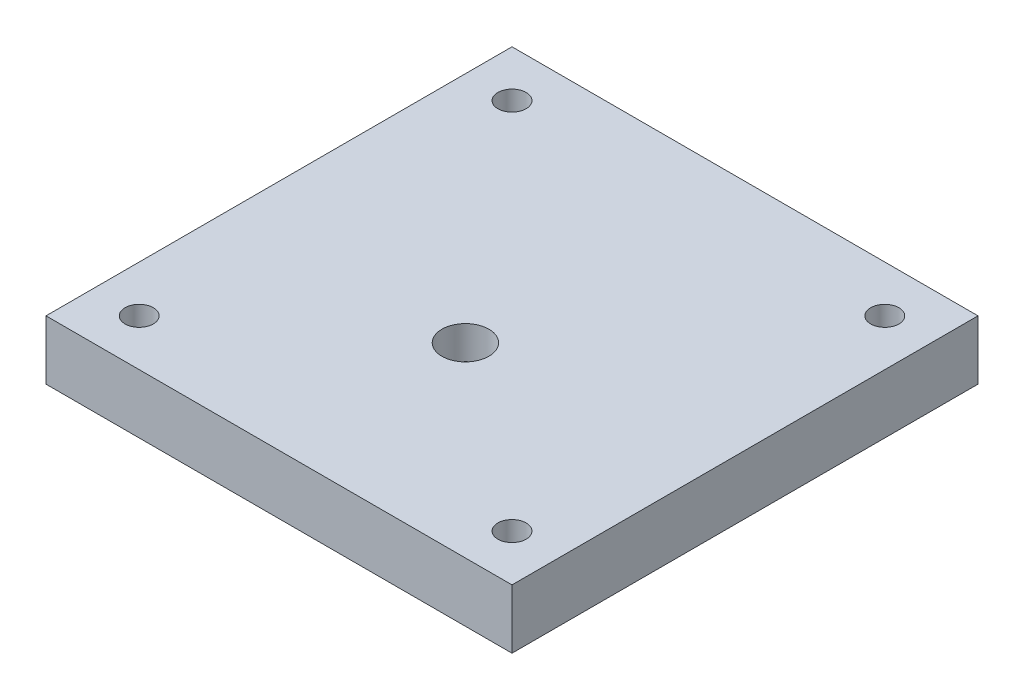
ISO-10303-21;
HEADER;
FILE_DESCRIPTION(('STEP AP214'),'2;1');
FILE_NAME('part.step','',(''),(''),'','','');
FILE_SCHEMA(('AUTOMOTIVE_DESIGN { 1 0 10303 214 1 1 1 1 }'));
ENDSEC;
DATA;
#1=APPLICATION_CONTEXT('core data for automotive mechanical design processes');
#2=APPLICATION_PROTOCOL_DEFINITION('international standard','automotive_design',2000,#1);
#3=PRODUCT_CONTEXT('',#1,'mechanical');
#4=PRODUCT('Part','Part','',(#3));
#5=PRODUCT_RELATED_PRODUCT_CATEGORY('part','',(#4));
#6=PRODUCT_DEFINITION_FORMATION('','',#4);
#7=PRODUCT_DEFINITION_CONTEXT('part definition',#1,'design');
#8=PRODUCT_DEFINITION('design','',#6,#7);
#9=PRODUCT_DEFINITION_SHAPE('','',#8);
#10=(LENGTH_UNIT() NAMED_UNIT(*) SI_UNIT(.MILLI.,.METRE.));
#11=(NAMED_UNIT(*) PLANE_ANGLE_UNIT() SI_UNIT($,.RADIAN.));
#12=(NAMED_UNIT(*) SI_UNIT($,.STERADIAN.) SOLID_ANGLE_UNIT());
#13=UNCERTAINTY_MEASURE_WITH_UNIT(LENGTH_MEASURE(1.E-05),#10,'distance_accuracy_value','');
#14=(GEOMETRIC_REPRESENTATION_CONTEXT(3) GLOBAL_UNCERTAINTY_ASSIGNED_CONTEXT((#13)) GLOBAL_UNIT_ASSIGNED_CONTEXT((#10,
#11,#12)) REPRESENTATION_CONTEXT('',''));
#15=CARTESIAN_POINT('',(0.,0.,0.));
#16=DIRECTION('',(0.,0.,1.));
#17=DIRECTION('',(1.,0.,0.));
#18=AXIS2_PLACEMENT_3D('',#15,#16,#17);
#19=CARTESIAN_POINT('',(-50.,12.7,-60.));
#20=DIRECTION('',(0.,0.,-1.));
#21=DIRECTION('',(-1.,0.,0.));
#22=AXIS2_PLACEMENT_3D('',#19,#20,#21);
#23=PLANE('',#22);
#24=DIRECTION('',(1.,0.,0.));
#25=VECTOR('',#24,1.);
#26=CARTESIAN_POINT('',(-50.,0.,-60.));
#27=LINE('',#26,#25);
#28=CARTESIAN_POINT('',(-50.,0.,-60.));
#29=VERTEX_POINT('',#28);
#30=CARTESIAN_POINT('',(50.,0.,-60.));
#31=VERTEX_POINT('',#30);
#32=EDGE_CURVE('E98',#29,#31,#27,.T.);
#33=ORIENTED_EDGE('',*,*,#32,.F.);
#34=DIRECTION('',(0.,-1.,0.));
#35=VECTOR('',#34,1.);
#36=CARTESIAN_POINT('',(-50.,12.7,-60.));
#37=LINE('',#36,#35);
#38=CARTESIAN_POINT('',(-50.,12.7,-60.));
#39=VERTEX_POINT('',#38);
#40=EDGE_CURVE('E11',#39,#29,#37,.T.);
#41=ORIENTED_EDGE('',*,*,#40,.F.);
#42=DIRECTION('',(1.,0.,0.));
#43=VECTOR('',#42,1.);
#44=CARTESIAN_POINT('',(-50.,12.7,-60.));
#45=LINE('',#44,#43);
#46=CARTESIAN_POINT('',(50.,12.7,-60.));
#47=VERTEX_POINT('',#46);
#48=EDGE_CURVE('E92',#39,#47,#45,.T.);
#49=ORIENTED_EDGE('',*,*,#48,.T.);
#50=DIRECTION('',(0.,-1.,0.));
#51=VECTOR('',#50,1.);
#52=CARTESIAN_POINT('',(50.,12.7,-60.));
#53=LINE('',#52,#51);
#54=EDGE_CURVE('E35',#47,#31,#53,.T.);
#55=ORIENTED_EDGE('',*,*,#54,.T.);
#56=EDGE_LOOP('',(#33,#41,#49,#55));
#57=FACE_BOUND('',#56,.T.);
#58=ADVANCED_FACE('F32',(#57),#23,.T.);
#59=CARTESIAN_POINT('',(-50.,12.7,-60.));
#60=DIRECTION('',(1.,0.,0.));
#61=DIRECTION('',(0.,0.,-1.));
#62=AXIS2_PLACEMENT_3D('',#59,#60,#61);
#63=PLANE('',#62);
#64=DIRECTION('',(0.,0.,1.));
#65=VECTOR('',#64,1.);
#66=CARTESIAN_POINT('',(-50.,0.,-60.));
#67=LINE('',#66,#65);
#68=CARTESIAN_POINT('',(-50.,0.,40.));
#69=VERTEX_POINT('',#68);
#70=EDGE_CURVE('E65',#29,#69,#67,.T.);
#71=ORIENTED_EDGE('',*,*,#70,.T.);
#72=DIRECTION('',(0.,-1.,0.));
#73=VECTOR('',#72,1.);
#74=CARTESIAN_POINT('',(-50.,12.7,40.));
#75=LINE('',#74,#73);
#76=CARTESIAN_POINT('',(-50.,12.7,40.));
#77=VERTEX_POINT('',#76);
#78=EDGE_CURVE('E41',#77,#69,#75,.T.);
#79=ORIENTED_EDGE('',*,*,#78,.F.);
#80=DIRECTION('',(0.,0.,1.));
#81=VECTOR('',#80,1.);
#82=CARTESIAN_POINT('',(-50.,12.7,-60.));
#83=LINE('',#82,#81);
#84=EDGE_CURVE('E82',#39,#77,#83,.T.);
#85=ORIENTED_EDGE('',*,*,#84,.F.);
#86=ORIENTED_EDGE('',*,*,#40,.T.);
#87=EDGE_LOOP('',(#71,#79,#85,#86));
#88=FACE_BOUND('',#87,.T.);
#89=ADVANCED_FACE('F109',(#88),#63,.F.);
#90=CARTESIAN_POINT('',(-50.,12.7,40.));
#91=DIRECTION('',(0.,0.,-1.));
#92=DIRECTION('',(-1.,0.,0.));
#93=AXIS2_PLACEMENT_3D('',#90,#91,#92);
#94=PLANE('',#93);
#95=DIRECTION('',(1.,0.,0.));
#96=VECTOR('',#95,1.);
#97=CARTESIAN_POINT('',(-50.,0.,40.));
#98=LINE('',#97,#96);
#99=CARTESIAN_POINT('',(50.,0.,40.));
#100=VERTEX_POINT('',#99);
#101=EDGE_CURVE('E89',#69,#100,#98,.T.);
#102=ORIENTED_EDGE('',*,*,#101,.T.);
#103=DIRECTION('',(0.,-1.,0.));
#104=VECTOR('',#103,1.);
#105=CARTESIAN_POINT('',(50.,12.7,40.));
#106=LINE('',#105,#104);
#107=CARTESIAN_POINT('',(50.,12.7,40.));
#108=VERTEX_POINT('',#107);
#109=EDGE_CURVE('E86',#108,#100,#106,.T.);
#110=ORIENTED_EDGE('',*,*,#109,.F.);
#111=DIRECTION('',(1.,0.,0.));
#112=VECTOR('',#111,1.);
#113=CARTESIAN_POINT('',(-50.,12.7,40.));
#114=LINE('',#113,#112);
#115=EDGE_CURVE('E77',#77,#108,#114,.T.);
#116=ORIENTED_EDGE('',*,*,#115,.F.);
#117=ORIENTED_EDGE('',*,*,#78,.T.);
#118=EDGE_LOOP('',(#102,#110,#116,#117));
#119=FACE_BOUND('',#118,.T.);
#120=ADVANCED_FACE('F87',(#119),#94,.F.);
#121=CARTESIAN_POINT('',(50.,12.7,-60.));
#122=DIRECTION('',(1.,0.,0.));
#123=DIRECTION('',(0.,0.,-1.));
#124=AXIS2_PLACEMENT_3D('',#121,#122,#123);
#125=PLANE('',#124);
#126=DIRECTION('',(0.,0.,1.));
#127=VECTOR('',#126,1.);
#128=CARTESIAN_POINT('',(50.,0.,-60.));
#129=LINE('',#128,#127);
#130=EDGE_CURVE('E101',#31,#100,#129,.T.);
#131=ORIENTED_EDGE('',*,*,#130,.F.);
#132=ORIENTED_EDGE('',*,*,#54,.F.);
#133=DIRECTION('',(0.,0.,1.));
#134=VECTOR('',#133,1.);
#135=CARTESIAN_POINT('',(50.,12.7,-60.));
#136=LINE('',#135,#134);
#137=EDGE_CURVE('E81',#47,#108,#136,.T.);
#138=ORIENTED_EDGE('',*,*,#137,.T.);
#139=ORIENTED_EDGE('',*,*,#109,.T.);
#140=EDGE_LOOP('',(#131,#132,#138,#139));
#141=FACE_BOUND('',#140,.T.);
#142=ADVANCED_FACE('F91',(#141),#125,.T.);
#143=CARTESIAN_POINT('',(0.,12.7,0.));
#144=DIRECTION('',(0.,-1.,0.));
#145=DIRECTION('',(0.,0.,-1.));
#146=AXIS2_PLACEMENT_3D('',#143,#144,#145);
#147=PLANE('',#146);
#148=CARTESIAN_POINT('',(0.,12.7,0.));
#149=DIRECTION('',(0.,-1.,0.));
#150=DIRECTION('',(0.,0.,-1.));
#151=AXIS2_PLACEMENT_3D('',#148,#149,#150);
#152=CIRCLE('',#151,5.0419);
#153=CARTESIAN_POINT('',(0.,12.7,-5.0419));
#154=VERTEX_POINT('',#153);
#155=EDGE_CURVE('E165',#154,#154,#152,.T.);
#156=ORIENTED_EDGE('',*,*,#155,.T.);
#157=EDGE_LOOP('',(#156));
#158=FACE_BOUND('',#157,.T.);
#159=CARTESIAN_POINT('',(-40.,12.7,-50.));
#160=DIRECTION('',(0.,1.,0.));
#161=DIRECTION('',(0.,0.,1.));
#162=AXIS2_PLACEMENT_3D('',#159,#160,#161);
#163=CIRCLE('',#162,3.02999999999998);
#164=CARTESIAN_POINT('',(-40.,12.7,-46.97));
#165=VERTEX_POINT('',#164);
#166=EDGE_CURVE('E169',#165,#165,#163,.T.);
#167=ORIENTED_EDGE('',*,*,#166,.F.);
#168=EDGE_LOOP('',(#167));
#169=FACE_BOUND('',#168,.T.);
#170=CARTESIAN_POINT('',(40.,12.7,-50.));
#171=DIRECTION('',(0.,1.,0.));
#172=DIRECTION('',(0.,0.,1.));
#173=AXIS2_PLACEMENT_3D('',#170,#171,#172);
#174=CIRCLE('',#173,3.02999999999998);
#175=CARTESIAN_POINT('',(40.,12.7,-46.97));
#176=VERTEX_POINT('',#175);
#177=EDGE_CURVE('E175',#176,#176,#174,.T.);
#178=ORIENTED_EDGE('',*,*,#177,.F.);
#179=EDGE_LOOP('',(#178));
#180=FACE_BOUND('',#179,.T.);
#181=CARTESIAN_POINT('',(40.,12.7,30.));
#182=DIRECTION('',(0.,1.,0.));
#183=DIRECTION('',(0.,0.,1.));
#184=AXIS2_PLACEMENT_3D('',#181,#182,#183);
#185=CIRCLE('',#184,3.02999999999998);
#186=CARTESIAN_POINT('',(40.,12.7,33.03));
#187=VERTEX_POINT('',#186);
#188=EDGE_CURVE('E181',#187,#187,#185,.T.);
#189=ORIENTED_EDGE('',*,*,#188,.F.);
#190=EDGE_LOOP('',(#189));
#191=FACE_BOUND('',#190,.T.);
#192=CARTESIAN_POINT('',(-40.,12.7,30.));
#193=DIRECTION('',(0.,1.,0.));
#194=DIRECTION('',(0.,0.,1.));
#195=AXIS2_PLACEMENT_3D('',#192,#193,#194);
#196=CIRCLE('',#195,3.02999999999998);
#197=CARTESIAN_POINT('',(-40.,12.7,33.03));
#198=VERTEX_POINT('',#197);
#199=EDGE_CURVE('E187',#198,#198,#196,.T.);
#200=ORIENTED_EDGE('',*,*,#199,.F.);
#201=EDGE_LOOP('',(#200));
#202=FACE_BOUND('',#201,.T.);
#203=ORIENTED_EDGE('',*,*,#48,.F.);
#204=ORIENTED_EDGE('',*,*,#84,.T.);
#205=ORIENTED_EDGE('',*,*,#115,.T.);
#206=ORIENTED_EDGE('',*,*,#137,.F.);
#207=EDGE_LOOP('',(#203,#204,#205,#206));
#208=FACE_BOUND('',#207,.T.);
#209=ADVANCED_FACE('F80',(#158,#169,#180,#191,#202,#208),#147,.F.);
#210=CARTESIAN_POINT('',(0.,0.,0.));
#211=DIRECTION('',(0.,-1.,0.));
#212=DIRECTION('',(0.,0.,-1.));
#213=AXIS2_PLACEMENT_3D('',#210,#211,#212);
#214=PLANE('',#213);
#215=CARTESIAN_POINT('',(0.,0.,0.));
#216=DIRECTION('',(0.,-1.,0.));
#217=DIRECTION('',(0.,0.,-1.));
#218=AXIS2_PLACEMENT_3D('',#215,#216,#217);
#219=CIRCLE('',#218,9.9187);
#220=CARTESIAN_POINT('',(0.,0.,-9.9187));
#221=VERTEX_POINT('',#220);
#222=EDGE_CURVE('E163',#221,#221,#219,.T.);
#223=ORIENTED_EDGE('',*,*,#222,.F.);
#224=EDGE_LOOP('',(#223));
#225=FACE_BOUND('',#224,.T.);
#226=CARTESIAN_POINT('',(-40.,0.,-50.));
#227=DIRECTION('',(0.,1.,0.));
#228=DIRECTION('',(0.,0.,1.));
#229=AXIS2_PLACEMENT_3D('',#226,#227,#228);
#230=CIRCLE('',#229,3.03);
#231=CARTESIAN_POINT('',(-40.,0.,-46.97));
#232=VERTEX_POINT('',#231);
#233=EDGE_CURVE('E172',#232,#232,#230,.T.);
#234=ORIENTED_EDGE('',*,*,#233,.T.);
#235=EDGE_LOOP('',(#234));
#236=FACE_BOUND('',#235,.T.);
#237=CARTESIAN_POINT('',(40.,0.,-50.));
#238=DIRECTION('',(0.,1.,0.));
#239=DIRECTION('',(0.,0.,1.));
#240=AXIS2_PLACEMENT_3D('',#237,#238,#239);
#241=CIRCLE('',#240,3.03);
#242=CARTESIAN_POINT('',(40.,0.,-46.97));
#243=VERTEX_POINT('',#242);
#244=EDGE_CURVE('E178',#243,#243,#241,.T.);
#245=ORIENTED_EDGE('',*,*,#244,.T.);
#246=EDGE_LOOP('',(#245));
#247=FACE_BOUND('',#246,.T.);
#248=CARTESIAN_POINT('',(40.,0.,30.));
#249=DIRECTION('',(0.,1.,0.));
#250=DIRECTION('',(0.,0.,1.));
#251=AXIS2_PLACEMENT_3D('',#248,#249,#250);
#252=CIRCLE('',#251,3.03);
#253=CARTESIAN_POINT('',(40.,0.,33.03));
#254=VERTEX_POINT('',#253);
#255=EDGE_CURVE('E184',#254,#254,#252,.T.);
#256=ORIENTED_EDGE('',*,*,#255,.T.);
#257=EDGE_LOOP('',(#256));
#258=FACE_BOUND('',#257,.T.);
#259=CARTESIAN_POINT('',(-40.,0.,30.));
#260=DIRECTION('',(0.,1.,0.));
#261=DIRECTION('',(0.,0.,1.));
#262=AXIS2_PLACEMENT_3D('',#259,#260,#261);
#263=CIRCLE('',#262,3.03);
#264=CARTESIAN_POINT('',(-40.,0.,33.03));
#265=VERTEX_POINT('',#264);
#266=EDGE_CURVE('E102',#265,#265,#263,.T.);
#267=ORIENTED_EDGE('',*,*,#266,.T.);
#268=EDGE_LOOP('',(#267));
#269=FACE_BOUND('',#268,.T.);
#270=ORIENTED_EDGE('',*,*,#32,.T.);
#271=ORIENTED_EDGE('',*,*,#130,.T.);
#272=ORIENTED_EDGE('',*,*,#101,.F.);
#273=ORIENTED_EDGE('',*,*,#70,.F.);
#274=EDGE_LOOP('',(#270,#271,#272,#273));
#275=FACE_BOUND('',#274,.T.);
#276=ADVANCED_FACE('F107',(#225,#236,#247,#258,#269,#275),#214,.T.);
#277=CARTESIAN_POINT('',(-40.,12.7,30.));
#278=DIRECTION('',(0.,1.,0.));
#279=DIRECTION('',(0.,0.,1.));
#280=AXIS2_PLACEMENT_3D('',#277,#278,#279);
#281=CYLINDRICAL_SURFACE('',#280,3.02999999999999);
#282=ORIENTED_EDGE('',*,*,#266,.F.);
#283=EDGE_LOOP('',(#282));
#284=FACE_BOUND('',#283,.T.);
#285=ORIENTED_EDGE('',*,*,#199,.T.);
#286=EDGE_LOOP('',(#285));
#287=FACE_BOUND('',#286,.T.);
#288=ADVANCED_FACE('F128',(#284,#287),#281,.F.);
#289=CARTESIAN_POINT('',(40.,12.7,30.));
#290=DIRECTION('',(0.,1.,0.));
#291=DIRECTION('',(0.,0.,1.));
#292=AXIS2_PLACEMENT_3D('',#289,#290,#291);
#293=CYLINDRICAL_SURFACE('',#292,3.02999999999999);
#294=ORIENTED_EDGE('',*,*,#255,.F.);
#295=EDGE_LOOP('',(#294));
#296=FACE_BOUND('',#295,.T.);
#297=ORIENTED_EDGE('',*,*,#188,.T.);
#298=EDGE_LOOP('',(#297));
#299=FACE_BOUND('',#298,.T.);
#300=ADVANCED_FACE('F135',(#296,#299),#293,.F.);
#301=CARTESIAN_POINT('',(40.,12.7,-50.));
#302=DIRECTION('',(0.,1.,0.));
#303=DIRECTION('',(0.,0.,1.));
#304=AXIS2_PLACEMENT_3D('',#301,#302,#303);
#305=CYLINDRICAL_SURFACE('',#304,3.02999999999999);
#306=ORIENTED_EDGE('',*,*,#244,.F.);
#307=EDGE_LOOP('',(#306));
#308=FACE_BOUND('',#307,.T.);
#309=ORIENTED_EDGE('',*,*,#177,.T.);
#310=EDGE_LOOP('',(#309));
#311=FACE_BOUND('',#310,.T.);
#312=ADVANCED_FACE('F139',(#308,#311),#305,.F.);
#313=CARTESIAN_POINT('',(-40.,12.7,-50.));
#314=DIRECTION('',(0.,1.,0.));
#315=DIRECTION('',(0.,0.,1.));
#316=AXIS2_PLACEMENT_3D('',#313,#314,#315);
#317=CYLINDRICAL_SURFACE('',#316,3.02999999999999);
#318=ORIENTED_EDGE('',*,*,#233,.F.);
#319=EDGE_LOOP('',(#318));
#320=FACE_BOUND('',#319,.T.);
#321=ORIENTED_EDGE('',*,*,#166,.T.);
#322=EDGE_LOOP('',(#321));
#323=FACE_BOUND('',#322,.T.);
#324=ADVANCED_FACE('F143',(#320,#323),#317,.F.);
#325=CARTESIAN_POINT('',(0.,0.,0.));
#326=DIRECTION('',(0.,-1.,0.));
#327=DIRECTION('',(0.,0.,-1.));
#328=AXIS2_PLACEMENT_3D('',#325,#326,#327);
#329=CYLINDRICAL_SURFACE('',#328,5.0419);
#330=ORIENTED_EDGE('',*,*,#155,.F.);
#331=EDGE_LOOP('',(#330));
#332=FACE_BOUND('',#331,.T.);
#333=CARTESIAN_POINT('',(0.,5.61011664833542,0.));
#334=DIRECTION('',(0.,-1.,0.));
#335=DIRECTION('',(0.,0.,-1.));
#336=AXIS2_PLACEMENT_3D('',#333,#334,#335);
#337=CIRCLE('',#336,5.0419);
#338=CARTESIAN_POINT('',(0.,5.61011664833542,-5.0419));
#339=VERTEX_POINT('',#338);
#340=EDGE_CURVE('E160',#339,#339,#337,.T.);
#341=ORIENTED_EDGE('',*,*,#340,.T.);
#342=EDGE_LOOP('',(#341));
#343=FACE_BOUND('',#342,.T.);
#344=ADVANCED_FACE('F147',(#332,#343),#329,.F.);
#345=CARTESIAN_POINT('',(0.,0.,0.));
#346=DIRECTION('',(0.,-1.,0.));
#347=DIRECTION('',(0.,0.,-1.));
#348=AXIS2_PLACEMENT_3D('',#345,#346,#347);
#349=CONICAL_SURFACE('',#348,9.9187,0.715584993317675);
#350=ORIENTED_EDGE('',*,*,#340,.F.);
#351=EDGE_LOOP('',(#350));
#352=FACE_BOUND('',#351,.T.);
#353=ORIENTED_EDGE('',*,*,#222,.T.);
#354=EDGE_LOOP('',(#353));
#355=FACE_BOUND('',#354,.T.);
#356=ADVANCED_FACE('F151',(#352,#355),#349,.F.);
#357=CLOSED_SHELL('',(#58,#89,#120,#142,#209,#276,#288,#300,#312,#324,#344,#356));
#358=MANIFOLD_SOLID_BREP('B2',#357);
#359=ADVANCED_BREP_SHAPE_REPRESENTATION('',(#18,#358),#14);
#360=SHAPE_DEFINITION_REPRESENTATION(#9,#359);
ENDSEC;
END-ISO-10303-21;
